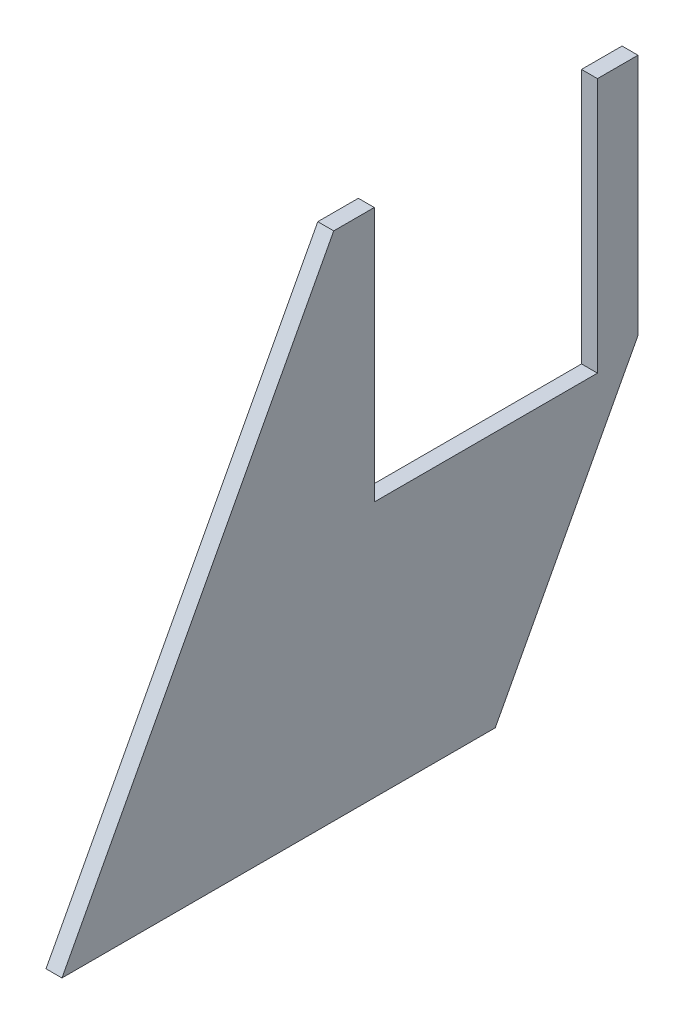
ISO-10303-21;
HEADER;
FILE_DESCRIPTION(('STEP AP214'),'2;1');
FILE_NAME('part.step','',(''),(''),'','','');
FILE_SCHEMA(('AUTOMOTIVE_DESIGN { 1 0 10303 214 1 1 1 1 }'));
ENDSEC;
DATA;
#1=APPLICATION_CONTEXT('core data for automotive mechanical design processes');
#2=APPLICATION_PROTOCOL_DEFINITION('international standard','automotive_design',2000,#1);
#3=PRODUCT_CONTEXT('',#1,'mechanical');
#4=PRODUCT('Part','Part','',(#3));
#5=PRODUCT_RELATED_PRODUCT_CATEGORY('part','',(#4));
#6=PRODUCT_DEFINITION_FORMATION('','',#4);
#7=PRODUCT_DEFINITION_CONTEXT('part definition',#1,'design');
#8=PRODUCT_DEFINITION('design','',#6,#7);
#9=PRODUCT_DEFINITION_SHAPE('','',#8);
#10=(LENGTH_UNIT() NAMED_UNIT(*) SI_UNIT(.MILLI.,.METRE.));
#11=(NAMED_UNIT(*) PLANE_ANGLE_UNIT() SI_UNIT($,.RADIAN.));
#12=(NAMED_UNIT(*) SI_UNIT($,.STERADIAN.) SOLID_ANGLE_UNIT());
#13=UNCERTAINTY_MEASURE_WITH_UNIT(LENGTH_MEASURE(1.E-05),#10,'distance_accuracy_value','');
#14=(GEOMETRIC_REPRESENTATION_CONTEXT(3) GLOBAL_UNCERTAINTY_ASSIGNED_CONTEXT((#13)) GLOBAL_UNIT_ASSIGNED_CONTEXT((#10,
#11,#12)) REPRESENTATION_CONTEXT('',''));
#15=CARTESIAN_POINT('',(0.,0.,0.));
#16=DIRECTION('',(0.,0.,1.));
#17=DIRECTION('',(1.,0.,0.));
#18=AXIS2_PLACEMENT_3D('',#15,#16,#17);
#19=CARTESIAN_POINT('',(-43.65,-0.00999999999995449,-170.265974623788));
#20=DIRECTION('',(-1.,0.,0.));
#21=DIRECTION('',(0.,0.,-1.));
#22=AXIS2_PLACEMENT_3D('',#19,#20,#21);
#23=PLANE('',#22);
#24=DIRECTION('',(0.,-0.882947592858925,0.469471562785895));
#25=VECTOR('',#24,1.);
#26=CARTESIAN_POINT('',(-43.65,0.,86.301837862505));
#27=LINE('',#26,#25);
#28=CARTESIAN_POINT('',(-43.65,203.6,-21.9542024237733));
#29=VERTEX_POINT('',#28);
#30=CARTESIAN_POINT('',(-43.65,0.,86.301837862505));
#31=VERTEX_POINT('',#30);
#32=EDGE_CURVE('E127',#29,#31,#27,.T.);
#33=ORIENTED_EDGE('',*,*,#32,.T.);
#34=DIRECTION('',(0.,0.,-1.));
#35=VECTOR('',#34,1.);
#36=CARTESIAN_POINT('',(-43.65,0.,0.));
#37=LINE('',#36,#35);
#38=CARTESIAN_POINT('',(-43.65,0.,-86.3018378625049));
#39=VERTEX_POINT('',#38);
#40=EDGE_CURVE('E43',#31,#39,#37,.T.);
#41=ORIENTED_EDGE('',*,*,#40,.T.);
#42=DIRECTION('',(0.,0.882947592858925,-0.469471562785895));
#43=VECTOR('',#42,1.);
#44=CARTESIAN_POINT('',(-43.65,106.923746647894,-143.154202423773));
#45=LINE('',#44,#43);
#46=CARTESIAN_POINT('',(-43.65,106.923746647894,-143.154202423773));
#47=VERTEX_POINT('',#46);
#48=EDGE_CURVE('E120',#39,#47,#45,.T.);
#49=ORIENTED_EDGE('',*,*,#48,.T.);
#50=DIRECTION('',(0.,1.,0.));
#51=VECTOR('',#50,1.);
#52=CARTESIAN_POINT('',(-43.65,203.6,-143.154202423773));
#53=LINE('',#52,#51);
#54=CARTESIAN_POINT('',(-43.65,203.6,-143.154202423773));
#55=VERTEX_POINT('',#54);
#56=EDGE_CURVE('E170',#47,#55,#53,.T.);
#57=ORIENTED_EDGE('',*,*,#56,.T.);
#58=DIRECTION('',(0.,0.,1.));
#59=VECTOR('',#58,1.);
#60=CARTESIAN_POINT('',(-43.65,203.6,0.));
#61=LINE('',#60,#59);
#62=CARTESIAN_POINT('',(-43.65,203.6,-127.004202423773));
#63=VERTEX_POINT('',#62);
#64=EDGE_CURVE('E137',#55,#63,#61,.T.);
#65=ORIENTED_EDGE('',*,*,#64,.T.);
#66=DIRECTION('',(0.,-1.,0.));
#67=VECTOR('',#66,1.);
#68=CARTESIAN_POINT('',(-43.65,0.,-127.004202423773));
#69=LINE('',#68,#67);
#70=CARTESIAN_POINT('',(-43.65,102.,-127.004202423773));
#71=VERTEX_POINT('',#70);
#72=EDGE_CURVE('E165',#63,#71,#69,.T.);
#73=ORIENTED_EDGE('',*,*,#72,.T.);
#74=DIRECTION('',(0.,0.,1.));
#75=VECTOR('',#74,1.);
#76=CARTESIAN_POINT('',(-43.65,102.,-38.1042024237733));
#77=LINE('',#76,#75);
#78=CARTESIAN_POINT('',(-43.65,102.,-38.1042024237734));
#79=VERTEX_POINT('',#78);
#80=EDGE_CURVE('E11',#71,#79,#77,.T.);
#81=ORIENTED_EDGE('',*,*,#80,.T.);
#82=DIRECTION('',(0.,1.,0.));
#83=VECTOR('',#82,1.);
#84=CARTESIAN_POINT('',(-43.65,0.,-38.1042024237734));
#85=LINE('',#84,#83);
#86=CARTESIAN_POINT('',(-43.65,203.6,-38.1042024237733));
#87=VERTEX_POINT('',#86);
#88=EDGE_CURVE('E167',#79,#87,#85,.T.);
#89=ORIENTED_EDGE('',*,*,#88,.T.);
#90=DIRECTION('',(0.,0.,1.));
#91=VECTOR('',#90,1.);
#92=CARTESIAN_POINT('',(-43.65,203.6,2.5115711979298E-13));
#93=LINE('',#92,#91);
#94=EDGE_CURVE('E140',#87,#29,#93,.T.);
#95=ORIENTED_EDGE('',*,*,#94,.T.);
#96=EDGE_LOOP('',(#33,#41,#49,#57,#65,#73,#81,#89,#95));
#97=FACE_BOUND('',#96,.T.);
#98=ADVANCED_FACE('F34',(#97),#23,.F.);
#99=CARTESIAN_POINT('',(-50.,203.6,-143.154202423773));
#100=DIRECTION('',(0.,0.,1.));
#101=DIRECTION('',(0.,-1.,0.));
#102=AXIS2_PLACEMENT_3D('',#99,#100,#101);
#103=PLANE('',#102);
#104=DIRECTION('',(1.,0.,0.));
#105=VECTOR('',#104,1.);
#106=CARTESIAN_POINT('',(-50.,106.923746647894,-143.154202423773));
#107=LINE('',#106,#105);
#108=CARTESIAN_POINT('',(-50.,106.923746647894,-143.154202423773));
#109=VERTEX_POINT('',#108);
#110=EDGE_CURVE('E123',#109,#47,#107,.T.);
#111=ORIENTED_EDGE('',*,*,#110,.F.);
#112=DIRECTION('',(0.,1.,0.));
#113=VECTOR('',#112,1.);
#114=CARTESIAN_POINT('',(-50.,203.6,-143.154202423773));
#115=LINE('',#114,#113);
#116=CARTESIAN_POINT('',(-50.,203.6,-143.154202423773));
#117=VERTEX_POINT('',#116);
#118=EDGE_CURVE('E144',#109,#117,#115,.T.);
#119=ORIENTED_EDGE('',*,*,#118,.T.);
#120=DIRECTION('',(1.,0.,0.));
#121=VECTOR('',#120,1.);
#122=CARTESIAN_POINT('',(-50.,203.6,-143.154202423773));
#123=LINE('',#122,#121);
#124=EDGE_CURVE('E156',#117,#55,#123,.T.);
#125=ORIENTED_EDGE('',*,*,#124,.T.);
#126=ORIENTED_EDGE('',*,*,#56,.F.);
#127=EDGE_LOOP('',(#111,#119,#125,#126));
#128=FACE_BOUND('',#127,.T.);
#129=ADVANCED_FACE('F185',(#128),#103,.F.);
#130=CARTESIAN_POINT('',(-50.,0.,86.301837862505));
#131=DIRECTION('',(0.,-0.469471562785895,-0.882947592858925));
#132=DIRECTION('',(0.,0.882947592858925,-0.469471562785895));
#133=AXIS2_PLACEMENT_3D('',#130,#131,#132);
#134=PLANE('',#133);
#135=DIRECTION('',(1.,0.,0.));
#136=VECTOR('',#135,1.);
#137=CARTESIAN_POINT('',(-50.,203.6,-21.9542024237733));
#138=LINE('',#137,#136);
#139=CARTESIAN_POINT('',(-50.,203.6,-21.9542024237733));
#140=VERTEX_POINT('',#139);
#141=EDGE_CURVE('E117',#140,#29,#138,.T.);
#142=ORIENTED_EDGE('',*,*,#141,.F.);
#143=DIRECTION('',(0.,-0.882947592858925,0.469471562785895));
#144=VECTOR('',#143,1.);
#145=CARTESIAN_POINT('',(-50.,0.,86.301837862505));
#146=LINE('',#145,#144);
#147=CARTESIAN_POINT('',(-50.,0.,86.301837862505));
#148=VERTEX_POINT('',#147);
#149=EDGE_CURVE('E136',#140,#148,#146,.T.);
#150=ORIENTED_EDGE('',*,*,#149,.T.);
#151=DIRECTION('',(1.,0.,0.));
#152=VECTOR('',#151,1.);
#153=CARTESIAN_POINT('',(-50.,0.,86.301837862505));
#154=LINE('',#153,#152);
#155=EDGE_CURVE('E131',#148,#31,#154,.T.);
#156=ORIENTED_EDGE('',*,*,#155,.T.);
#157=ORIENTED_EDGE('',*,*,#32,.F.);
#158=EDGE_LOOP('',(#142,#150,#156,#157));
#159=FACE_BOUND('',#158,.T.);
#160=ADVANCED_FACE('F179',(#159),#134,.F.);
#161=CARTESIAN_POINT('',(-50.,203.6,-120.654202423773));
#162=DIRECTION('',(0.,-1.,0.));
#163=DIRECTION('',(0.,0.,-1.));
#164=AXIS2_PLACEMENT_3D('',#161,#162,#163);
#165=PLANE('',#164);
#166=ORIENTED_EDGE('',*,*,#124,.F.);
#167=DIRECTION('',(0.,0.,1.));
#168=VECTOR('',#167,1.);
#169=CARTESIAN_POINT('',(-50.,203.6,-120.654202423773));
#170=LINE('',#169,#168);
#171=CARTESIAN_POINT('',(-50.,203.6,-127.004202423773));
#172=VERTEX_POINT('',#171);
#173=EDGE_CURVE('E147',#117,#172,#170,.T.);
#174=ORIENTED_EDGE('',*,*,#173,.T.);
#175=DIRECTION('',(-1.,0.,0.));
#176=VECTOR('',#175,1.);
#177=CARTESIAN_POINT('',(50.01,203.6,-127.004202423773));
#178=LINE('',#177,#176);
#179=EDGE_CURVE('E38',#63,#172,#178,.T.);
#180=ORIENTED_EDGE('',*,*,#179,.F.);
#181=ORIENTED_EDGE('',*,*,#64,.F.);
#182=EDGE_LOOP('',(#166,#174,#180,#181));
#183=FACE_BOUND('',#182,.T.);
#184=ADVANCED_FACE('F194',(#183),#165,.F.);
#185=CARTESIAN_POINT('',(-50.,0.,0.));
#186=DIRECTION('',(1.,0.,0.));
#187=DIRECTION('',(0.,0.,1.));
#188=AXIS2_PLACEMENT_3D('',#185,#186,#187);
#189=PLANE('',#188);
#190=DIRECTION('',(0.,1.,0.));
#191=VECTOR('',#190,1.);
#192=CARTESIAN_POINT('',(-50.,203.6,-127.004202423773));
#193=LINE('',#192,#191);
#194=CARTESIAN_POINT('',(-50.,102.,-127.004202423773));
#195=VERTEX_POINT('',#194);
#196=EDGE_CURVE('E161',#195,#172,#193,.T.);
#197=ORIENTED_EDGE('',*,*,#196,.T.);
#198=ORIENTED_EDGE('',*,*,#173,.F.);
#199=ORIENTED_EDGE('',*,*,#118,.F.);
#200=DIRECTION('',(0.,0.882947592858925,-0.469471562785895));
#201=VECTOR('',#200,1.);
#202=CARTESIAN_POINT('',(-50.,106.923746647894,-143.154202423773));
#203=LINE('',#202,#201);
#204=CARTESIAN_POINT('',(-50.,0.,-86.3018378625049));
#205=VERTEX_POINT('',#204);
#206=EDGE_CURVE('E142',#205,#109,#203,.T.);
#207=ORIENTED_EDGE('',*,*,#206,.F.);
#208=DIRECTION('',(0.,0.,-1.));
#209=VECTOR('',#208,1.);
#210=CARTESIAN_POINT('',(-50.,0.,-86.3018378625049));
#211=LINE('',#210,#209);
#212=EDGE_CURVE('E114',#148,#205,#211,.T.);
#213=ORIENTED_EDGE('',*,*,#212,.F.);
#214=ORIENTED_EDGE('',*,*,#149,.F.);
#215=DIRECTION('',(0.,0.,1.));
#216=VECTOR('',#215,1.);
#217=CARTESIAN_POINT('',(-50.,203.6,-21.9542024237733));
#218=LINE('',#217,#216);
#219=CARTESIAN_POINT('',(-50.,203.6,-38.1042024237733));
#220=VERTEX_POINT('',#219);
#221=EDGE_CURVE('E152',#220,#140,#218,.T.);
#222=ORIENTED_EDGE('',*,*,#221,.F.);
#223=DIRECTION('',(0.,-1.,0.));
#224=VECTOR('',#223,1.);
#225=CARTESIAN_POINT('',(-50.,203.6,-38.1042024237733));
#226=LINE('',#225,#224);
#227=CARTESIAN_POINT('',(-50.,102.,-38.1042024237733));
#228=VERTEX_POINT('',#227);
#229=EDGE_CURVE('E162',#220,#228,#226,.T.);
#230=ORIENTED_EDGE('',*,*,#229,.T.);
#231=DIRECTION('',(0.,0.,1.));
#232=VECTOR('',#231,1.);
#233=CARTESIAN_POINT('',(-50.,102.,-44.4542024237734));
#234=LINE('',#233,#232);
#235=EDGE_CURVE('E150',#195,#228,#234,.T.);
#236=ORIENTED_EDGE('',*,*,#235,.F.);
#237=EDGE_LOOP('',(#197,#198,#199,#207,#213,#214,#222,#230,#236));
#238=FACE_BOUND('',#237,.T.);
#239=ADVANCED_FACE('F181',(#238),#189,.F.);
#240=CARTESIAN_POINT('',(50.01,102.,-38.1042024237733));
#241=DIRECTION('',(0.,-1.,0.));
#242=DIRECTION('',(0.,0.,-1.));
#243=AXIS2_PLACEMENT_3D('',#240,#241,#242);
#244=PLANE('',#243);
#245=DIRECTION('',(-1.,0.,0.));
#246=VECTOR('',#245,1.);
#247=CARTESIAN_POINT('',(50.01,102.,-127.004202423773));
#248=LINE('',#247,#246);
#249=EDGE_CURVE('E59',#71,#195,#248,.T.);
#250=ORIENTED_EDGE('',*,*,#249,.T.);
#251=ORIENTED_EDGE('',*,*,#235,.T.);
#252=DIRECTION('',(-1.,0.,0.));
#253=VECTOR('',#252,1.);
#254=CARTESIAN_POINT('',(50.01,102.,-38.1042024237733));
#255=LINE('',#254,#253);
#256=EDGE_CURVE('E51',#79,#228,#255,.T.);
#257=ORIENTED_EDGE('',*,*,#256,.F.);
#258=ORIENTED_EDGE('',*,*,#80,.F.);
#259=EDGE_LOOP('',(#250,#251,#257,#258));
#260=FACE_BOUND('',#259,.T.);
#261=ADVANCED_FACE('F201',(#260),#244,.F.);
#262=CARTESIAN_POINT('',(50.01,203.6,-127.004202423773));
#263=DIRECTION('',(0.,0.,-1.));
#264=DIRECTION('',(1.,0.,0.));
#265=AXIS2_PLACEMENT_3D('',#262,#263,#264);
#266=PLANE('',#265);
#267=ORIENTED_EDGE('',*,*,#72,.F.);
#268=ORIENTED_EDGE('',*,*,#179,.T.);
#269=ORIENTED_EDGE('',*,*,#196,.F.);
#270=ORIENTED_EDGE('',*,*,#249,.F.);
#271=EDGE_LOOP('',(#267,#268,#269,#270));
#272=FACE_BOUND('',#271,.T.);
#273=ADVANCED_FACE('F192',(#272),#266,.F.);
#274=CARTESIAN_POINT('',(-50.,106.923746647894,-143.154202423773));
#275=DIRECTION('',(0.,0.469471562785895,0.882947592858925));
#276=DIRECTION('',(0.,-0.882947592858925,0.469471562785895));
#277=AXIS2_PLACEMENT_3D('',#274,#275,#276);
#278=PLANE('',#277);
#279=DIRECTION('',(1.,0.,0.));
#280=VECTOR('',#279,1.);
#281=CARTESIAN_POINT('',(-50.,0.,-86.3018378625049));
#282=LINE('',#281,#280);
#283=EDGE_CURVE('E108',#205,#39,#282,.T.);
#284=ORIENTED_EDGE('',*,*,#283,.F.);
#285=ORIENTED_EDGE('',*,*,#206,.T.);
#286=ORIENTED_EDGE('',*,*,#110,.T.);
#287=ORIENTED_EDGE('',*,*,#48,.F.);
#288=EDGE_LOOP('',(#284,#285,#286,#287));
#289=FACE_BOUND('',#288,.T.);
#290=ADVANCED_FACE('F121',(#289),#278,.F.);
#291=CARTESIAN_POINT('',(62.575,0.,-143.164202423773));
#292=DIRECTION('',(0.,-1.,0.));
#293=DIRECTION('',(-1.,0.,0.));
#294=AXIS2_PLACEMENT_3D('',#291,#292,#293);
#295=PLANE('',#294);
#296=ORIENTED_EDGE('',*,*,#40,.F.);
#297=ORIENTED_EDGE('',*,*,#155,.F.);
#298=ORIENTED_EDGE('',*,*,#212,.T.);
#299=ORIENTED_EDGE('',*,*,#283,.T.);
#300=EDGE_LOOP('',(#296,#297,#298,#299));
#301=FACE_BOUND('',#300,.T.);
#302=ADVANCED_FACE('F110',(#301),#295,.T.);
#303=CARTESIAN_POINT('',(-50.,203.6,-21.9542024237733));
#304=DIRECTION('',(0.,-1.,0.));
#305=DIRECTION('',(0.,0.,-1.));
#306=AXIS2_PLACEMENT_3D('',#303,#304,#305);
#307=PLANE('',#306);
#308=ORIENTED_EDGE('',*,*,#94,.F.);
#309=DIRECTION('',(-1.,0.,0.));
#310=VECTOR('',#309,1.);
#311=CARTESIAN_POINT('',(50.01,203.6,-38.1042024237733));
#312=LINE('',#311,#310);
#313=EDGE_CURVE('E159',#87,#220,#312,.T.);
#314=ORIENTED_EDGE('',*,*,#313,.T.);
#315=ORIENTED_EDGE('',*,*,#221,.T.);
#316=ORIENTED_EDGE('',*,*,#141,.T.);
#317=EDGE_LOOP('',(#308,#314,#315,#316));
#318=FACE_BOUND('',#317,.T.);
#319=ADVANCED_FACE('F174',(#318),#307,.F.);
#320=CARTESIAN_POINT('',(50.01,203.6,-38.1042024237733));
#321=DIRECTION('',(0.,0.,1.));
#322=DIRECTION('',(-1.,0.,0.));
#323=AXIS2_PLACEMENT_3D('',#320,#321,#322);
#324=PLANE('',#323);
#325=ORIENTED_EDGE('',*,*,#88,.F.);
#326=ORIENTED_EDGE('',*,*,#256,.T.);
#327=ORIENTED_EDGE('',*,*,#229,.F.);
#328=ORIENTED_EDGE('',*,*,#313,.F.);
#329=EDGE_LOOP('',(#325,#326,#327,#328));
#330=FACE_BOUND('',#329,.T.);
#331=ADVANCED_FACE('F36',(#330),#324,.F.);
#332=CLOSED_SHELL('',(#98,#129,#160,#184,#239,#261,#273,#290,#302,#319,#331));
#333=MANIFOLD_SOLID_BREP('B2',#332);
#334=ADVANCED_BREP_SHAPE_REPRESENTATION('',(#18,#333),#14);
#335=SHAPE_DEFINITION_REPRESENTATION(#9,#334);
ENDSEC;
END-ISO-10303-21;
